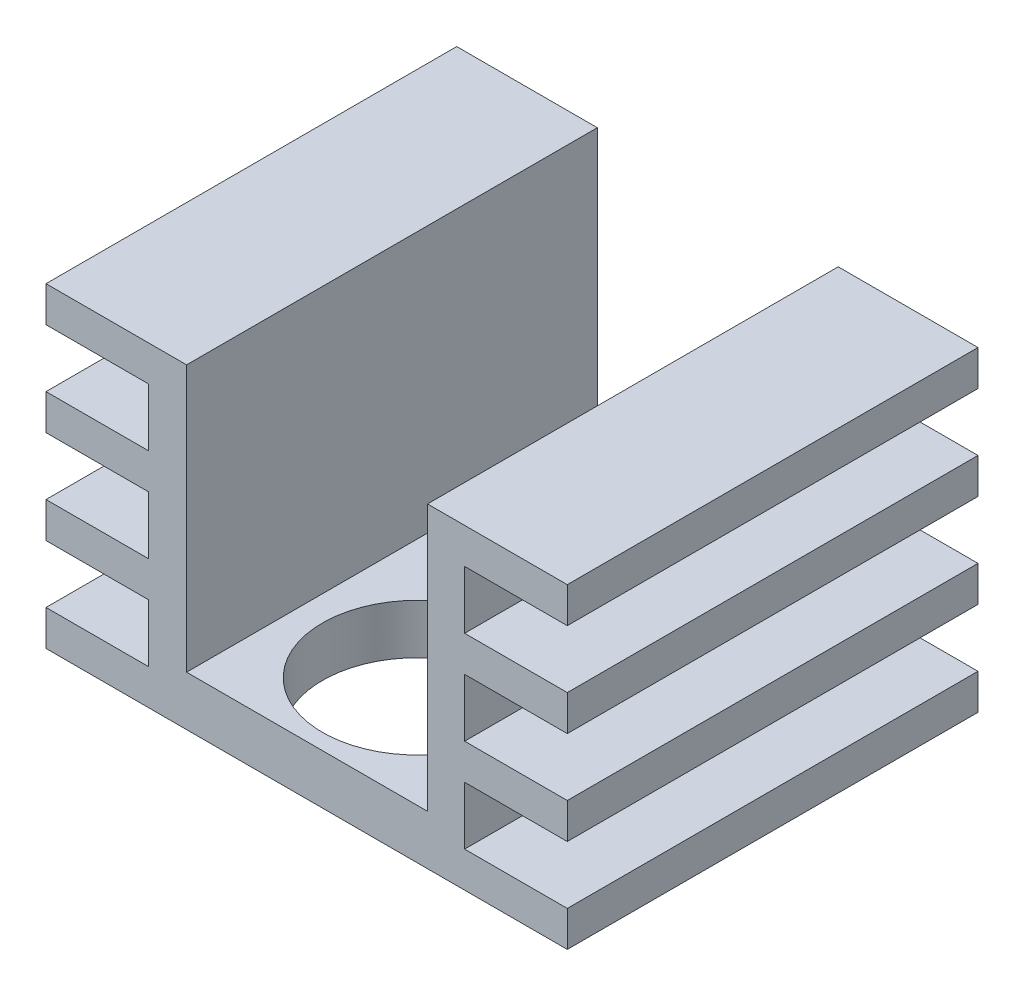
ISO-10303-21;
HEADER;
FILE_DESCRIPTION(('STEP AP214'),'2;1');
FILE_NAME('part.step','',(''),(''),'','','');
FILE_SCHEMA(('AUTOMOTIVE_DESIGN { 1 0 10303 214 1 1 1 1 }'));
ENDSEC;
DATA;
#1=APPLICATION_CONTEXT('core data for automotive mechanical design processes');
#2=APPLICATION_PROTOCOL_DEFINITION('international standard','automotive_design',2000,#1);
#3=PRODUCT_CONTEXT('',#1,'mechanical');
#4=PRODUCT('Part','Part','',(#3));
#5=PRODUCT_RELATED_PRODUCT_CATEGORY('part','',(#4));
#6=PRODUCT_DEFINITION_FORMATION('','',#4);
#7=PRODUCT_DEFINITION_CONTEXT('part definition',#1,'design');
#8=PRODUCT_DEFINITION('design','',#6,#7);
#9=PRODUCT_DEFINITION_SHAPE('','',#8);
#10=(LENGTH_UNIT() NAMED_UNIT(*) SI_UNIT(.MILLI.,.METRE.));
#11=(NAMED_UNIT(*) PLANE_ANGLE_UNIT() SI_UNIT($,.RADIAN.));
#12=(NAMED_UNIT(*) SI_UNIT($,.STERADIAN.) SOLID_ANGLE_UNIT());
#13=UNCERTAINTY_MEASURE_WITH_UNIT(LENGTH_MEASURE(1.E-05),#10,'distance_accuracy_value','');
#14=(GEOMETRIC_REPRESENTATION_CONTEXT(3) GLOBAL_UNCERTAINTY_ASSIGNED_CONTEXT((#13)) GLOBAL_UNIT_ASSIGNED_CONTEXT((#10,
#11,#12)) REPRESENTATION_CONTEXT('',''));
#15=CARTESIAN_POINT('',(0.,0.,0.));
#16=DIRECTION('',(0.,0.,1.));
#17=DIRECTION('',(1.,0.,0.));
#18=AXIS2_PLACEMENT_3D('',#15,#16,#17);
#19=CARTESIAN_POINT('',(0.,20.,0.));
#20=DIRECTION('',(0.,-1.,0.));
#21=DIRECTION('',(0.,0.,-1.));
#22=AXIS2_PLACEMENT_3D('',#19,#20,#21);
#23=PLANE('',#22);
#24=DIRECTION('',(1.,0.,0.));
#25=VECTOR('',#24,1.);
#26=CARTESIAN_POINT('',(33.,20.,0.));
#27=LINE('',#26,#25);
#28=CARTESIAN_POINT('',(0.,20.,0.));
#29=VERTEX_POINT('',#28);
#30=CARTESIAN_POINT('',(8.9,20.,0.));
#31=VERTEX_POINT('',#30);
#32=EDGE_CURVE('E437',#29,#31,#27,.T.);
#33=ORIENTED_EDGE('',*,*,#32,.T.);
#34=DIRECTION('',(0.,0.,1.));
#35=VECTOR('',#34,1.);
#36=CARTESIAN_POINT('',(8.9,20.,-26.));
#37=LINE('',#36,#35);
#38=CARTESIAN_POINT('',(8.9,20.,-26.));
#39=VERTEX_POINT('',#38);
#40=EDGE_CURVE('E272',#39,#31,#37,.T.);
#41=ORIENTED_EDGE('',*,*,#40,.F.);
#42=DIRECTION('',(-1.,0.,0.));
#43=VECTOR('',#42,1.);
#44=CARTESIAN_POINT('',(0.,20.,-26.));
#45=LINE('',#44,#43);
#46=CARTESIAN_POINT('',(0.,20.,-26.));
#47=VERTEX_POINT('',#46);
#48=EDGE_CURVE('E263',#39,#47,#45,.T.);
#49=ORIENTED_EDGE('',*,*,#48,.T.);
#50=DIRECTION('',(0.,0.,1.));
#51=VECTOR('',#50,1.);
#52=CARTESIAN_POINT('',(0.,20.,0.));
#53=LINE('',#52,#51);
#54=EDGE_CURVE('E446',#47,#29,#53,.T.);
#55=ORIENTED_EDGE('',*,*,#54,.T.);
#56=EDGE_LOOP('',(#33,#41,#49,#55));
#57=FACE_BOUND('',#56,.T.);
#58=ADVANCED_FACE('F32',(#57),#23,.F.);
#59=CARTESIAN_POINT('',(33.,20.,-26.));
#60=DIRECTION('',(-1.,0.,0.));
#61=DIRECTION('',(0.,0.,1.));
#62=AXIS2_PLACEMENT_3D('',#59,#60,#61);
#63=PLANE('',#62);
#64=DIRECTION('',(0.,-1.,0.));
#65=VECTOR('',#64,1.);
#66=CARTESIAN_POINT('',(33.,20.,-26.));
#67=LINE('',#66,#65);
#68=CARTESIAN_POINT('',(33.,2.25,-26.));
#69=VERTEX_POINT('',#68);
#70=CARTESIAN_POINT('',(33.,0.,-26.));
#71=VERTEX_POINT('',#70);
#72=EDGE_CURVE('E469',#69,#71,#67,.T.);
#73=ORIENTED_EDGE('',*,*,#72,.F.);
#74=DIRECTION('',(0.,0.,1.));
#75=VECTOR('',#74,1.);
#76=CARTESIAN_POINT('',(33.,2.25,-26.));
#77=LINE('',#76,#75);
#78=CARTESIAN_POINT('',(33.,2.25,0.));
#79=VERTEX_POINT('',#78);
#80=EDGE_CURVE('E294',#69,#79,#77,.T.);
#81=ORIENTED_EDGE('',*,*,#80,.T.);
#82=DIRECTION('',(0.,-1.,0.));
#83=VECTOR('',#82,1.);
#84=CARTESIAN_POINT('',(33.,20.,0.));
#85=LINE('',#84,#83);
#86=CARTESIAN_POINT('',(33.,0.,0.));
#87=VERTEX_POINT('',#86);
#88=EDGE_CURVE('E42',#79,#87,#85,.T.);
#89=ORIENTED_EDGE('',*,*,#88,.T.);
#90=DIRECTION('',(0.,0.,-1.));
#91=VECTOR('',#90,1.);
#92=CARTESIAN_POINT('',(33.,0.,-26.));
#93=LINE('',#92,#91);
#94=EDGE_CURVE('E451',#87,#71,#93,.T.);
#95=ORIENTED_EDGE('',*,*,#94,.T.);
#96=EDGE_LOOP('',(#73,#81,#89,#95));
#97=FACE_BOUND('',#96,.T.);
#98=ADVANCED_FACE('F502',(#97),#63,.F.);
#99=CARTESIAN_POINT('',(33.,8.16666666666667,0.));
#100=VERTEX_POINT('',#99);
#101=CARTESIAN_POINT('',(33.,5.91666666666667,0.));
#102=VERTEX_POINT('',#101);
#103=EDGE_CURVE('E477',#100,#102,#85,.T.);
#104=ORIENTED_EDGE('',*,*,#103,.T.);
#105=DIRECTION('',(0.,0.,1.));
#106=VECTOR('',#105,1.);
#107=CARTESIAN_POINT('',(33.,5.91666666666667,-26.));
#108=LINE('',#107,#106);
#109=CARTESIAN_POINT('',(33.,5.91666666666667,-26.));
#110=VERTEX_POINT('',#109);
#111=EDGE_CURVE('E286',#110,#102,#108,.T.);
#112=ORIENTED_EDGE('',*,*,#111,.F.);
#113=CARTESIAN_POINT('',(33.,8.16666666666667,-26.));
#114=VERTEX_POINT('',#113);
#115=EDGE_CURVE('E479',#114,#110,#67,.T.);
#116=ORIENTED_EDGE('',*,*,#115,.F.);
#117=DIRECTION('',(0.,0.,1.));
#118=VECTOR('',#117,1.);
#119=CARTESIAN_POINT('',(33.,8.16666666666667,-26.));
#120=LINE('',#119,#118);
#121=EDGE_CURVE('E320',#114,#100,#120,.T.);
#122=ORIENTED_EDGE('',*,*,#121,.T.);
#123=EDGE_LOOP('',(#104,#112,#116,#122));
#124=FACE_BOUND('',#123,.T.);
#125=ADVANCED_FACE('F487',(#124),#63,.F.);
#126=CARTESIAN_POINT('',(33.,14.0833333333333,0.));
#127=VERTEX_POINT('',#126);
#128=CARTESIAN_POINT('',(33.,11.8333333333333,0.));
#129=VERTEX_POINT('',#128);
#130=EDGE_CURVE('E41',#127,#129,#85,.T.);
#131=ORIENTED_EDGE('',*,*,#130,.T.);
#132=DIRECTION('',(0.,0.,1.));
#133=VECTOR('',#132,1.);
#134=CARTESIAN_POINT('',(33.,11.8333333333333,-26.));
#135=LINE('',#134,#133);
#136=CARTESIAN_POINT('',(33.,11.8333333333333,-26.));
#137=VERTEX_POINT('',#136);
#138=EDGE_CURVE('E313',#137,#129,#135,.T.);
#139=ORIENTED_EDGE('',*,*,#138,.F.);
#140=CARTESIAN_POINT('',(33.,14.0833333333333,-26.));
#141=VERTEX_POINT('',#140);
#142=EDGE_CURVE('E474',#141,#137,#67,.T.);
#143=ORIENTED_EDGE('',*,*,#142,.F.);
#144=DIRECTION('',(0.,0.,1.));
#145=VECTOR('',#144,1.);
#146=CARTESIAN_POINT('',(33.,14.0833333333333,-26.));
#147=LINE('',#146,#145);
#148=EDGE_CURVE('E346',#141,#127,#147,.T.);
#149=ORIENTED_EDGE('',*,*,#148,.T.);
#150=EDGE_LOOP('',(#131,#139,#143,#149));
#151=FACE_BOUND('',#150,.T.);
#152=ADVANCED_FACE('F546',(#151),#63,.F.);
#153=CARTESIAN_POINT('',(0.,20.,0.));
#154=DIRECTION('',(1.,0.,0.));
#155=DIRECTION('',(0.,0.,-1.));
#156=AXIS2_PLACEMENT_3D('',#153,#154,#155);
#157=PLANE('',#156);
#158=DIRECTION('',(0.,-1.,0.));
#159=VECTOR('',#158,1.);
#160=CARTESIAN_POINT('',(0.,20.,-26.));
#161=LINE('',#160,#159);
#162=CARTESIAN_POINT('',(0.,17.75,-26.));
#163=VERTEX_POINT('',#162);
#164=EDGE_CURVE('E466',#47,#163,#161,.T.);
#165=ORIENTED_EDGE('',*,*,#164,.T.);
#166=DIRECTION('',(0.,0.,1.));
#167=VECTOR('',#166,1.);
#168=CARTESIAN_POINT('',(0.,17.75,-26.));
#169=LINE('',#168,#167);
#170=CARTESIAN_POINT('',(0.,17.75,0.));
#171=VERTEX_POINT('',#170);
#172=EDGE_CURVE('E372',#163,#171,#169,.T.);
#173=ORIENTED_EDGE('',*,*,#172,.T.);
#174=DIRECTION('',(0.,-1.,0.));
#175=VECTOR('',#174,1.);
#176=CARTESIAN_POINT('',(0.,20.,0.));
#177=LINE('',#176,#175);
#178=EDGE_CURVE('E460',#29,#171,#177,.T.);
#179=ORIENTED_EDGE('',*,*,#178,.F.);
#180=ORIENTED_EDGE('',*,*,#54,.F.);
#181=EDGE_LOOP('',(#165,#173,#179,#180));
#182=FACE_BOUND('',#181,.T.);
#183=ADVANCED_FACE('F538',(#182),#157,.F.);
#184=CARTESIAN_POINT('',(0.,2.25,0.));
#185=VERTEX_POINT('',#184);
#186=CARTESIAN_POINT('',(0.,0.,0.));
#187=VERTEX_POINT('',#186);
#188=EDGE_CURVE('E448',#185,#187,#177,.T.);
#189=ORIENTED_EDGE('',*,*,#188,.F.);
#190=DIRECTION('',(0.,0.,1.));
#191=VECTOR('',#190,1.);
#192=CARTESIAN_POINT('',(0.,2.25,-26.));
#193=LINE('',#192,#191);
#194=CARTESIAN_POINT('',(0.,2.25,-26.));
#195=VERTEX_POINT('',#194);
#196=EDGE_CURVE('E401',#195,#185,#193,.T.);
#197=ORIENTED_EDGE('',*,*,#196,.F.);
#198=CARTESIAN_POINT('',(0.,0.,-26.));
#199=VERTEX_POINT('',#198);
#200=EDGE_CURVE('E463',#195,#199,#161,.T.);
#201=ORIENTED_EDGE('',*,*,#200,.T.);
#202=DIRECTION('',(0.,0.,1.));
#203=VECTOR('',#202,1.);
#204=CARTESIAN_POINT('',(0.,0.,0.));
#205=LINE('',#204,#203);
#206=EDGE_CURVE('E457',#199,#187,#205,.T.);
#207=ORIENTED_EDGE('',*,*,#206,.T.);
#208=EDGE_LOOP('',(#189,#197,#201,#207));
#209=FACE_BOUND('',#208,.T.);
#210=ADVANCED_FACE('F536',(#209),#157,.F.);
#211=CARTESIAN_POINT('',(0.,14.0833333333333,0.));
#212=VERTEX_POINT('',#211);
#213=CARTESIAN_POINT('',(0.,11.8333333333333,0.));
#214=VERTEX_POINT('',#213);
#215=EDGE_CURVE('E464',#212,#214,#177,.T.);
#216=ORIENTED_EDGE('',*,*,#215,.F.);
#217=DIRECTION('',(0.,0.,1.));
#218=VECTOR('',#217,1.);
#219=CARTESIAN_POINT('',(0.,14.0833333333333,-26.));
#220=LINE('',#219,#218);
#221=CARTESIAN_POINT('',(0.,14.0833333333333,-26.));
#222=VERTEX_POINT('',#221);
#223=EDGE_CURVE('E365',#222,#212,#220,.T.);
#224=ORIENTED_EDGE('',*,*,#223,.F.);
#225=CARTESIAN_POINT('',(0.,11.8333333333333,-26.));
#226=VERTEX_POINT('',#225);
#227=EDGE_CURVE('E470',#222,#226,#161,.T.);
#228=ORIENTED_EDGE('',*,*,#227,.T.);
#229=DIRECTION('',(0.,0.,1.));
#230=VECTOR('',#229,1.);
#231=CARTESIAN_POINT('',(0.,11.8333333333333,-26.));
#232=LINE('',#231,#230);
#233=EDGE_CURVE('E425',#226,#214,#232,.T.);
#234=ORIENTED_EDGE('',*,*,#233,.T.);
#235=EDGE_LOOP('',(#216,#224,#228,#234));
#236=FACE_BOUND('',#235,.T.);
#237=ADVANCED_FACE('F519',(#236),#157,.F.);
#238=CARTESIAN_POINT('',(33.,20.,-26.));
#239=VERTEX_POINT('',#238);
#240=CARTESIAN_POINT('',(24.15,20.,-26.));
#241=VERTEX_POINT('',#240);
#242=EDGE_CURVE('E443',#239,#241,#45,.T.);
#243=ORIENTED_EDGE('',*,*,#242,.T.);
#244=DIRECTION('',(0.,0.,1.));
#245=VECTOR('',#244,1.);
#246=CARTESIAN_POINT('',(24.15,20.,-26.));
#247=LINE('',#246,#245);
#248=CARTESIAN_POINT('',(24.15,20.,0.));
#249=VERTEX_POINT('',#248);
#250=EDGE_CURVE('E274',#241,#249,#247,.T.);
#251=ORIENTED_EDGE('',*,*,#250,.T.);
#252=CARTESIAN_POINT('',(33.,20.,0.));
#253=VERTEX_POINT('',#252);
#254=EDGE_CURVE('E441',#249,#253,#27,.T.);
#255=ORIENTED_EDGE('',*,*,#254,.T.);
#256=DIRECTION('',(0.,0.,-1.));
#257=VECTOR('',#256,1.);
#258=CARTESIAN_POINT('',(33.,20.,-26.));
#259=LINE('',#258,#257);
#260=EDGE_CURVE('E440',#253,#239,#259,.T.);
#261=ORIENTED_EDGE('',*,*,#260,.T.);
#262=EDGE_LOOP('',(#243,#251,#255,#261));
#263=FACE_BOUND('',#262,.T.);
#264=ADVANCED_FACE('F544',(#263),#23,.F.);
#265=CARTESIAN_POINT('',(0.,0.,0.));
#266=DIRECTION('',(0.,-1.,0.));
#267=DIRECTION('',(0.,0.,-1.));
#268=AXIS2_PLACEMENT_3D('',#265,#266,#267);
#269=PLANE('',#268);
#270=DIRECTION('',(1.,0.,0.));
#271=VECTOR('',#270,1.);
#272=CARTESIAN_POINT('',(33.,0.,0.));
#273=LINE('',#272,#271);
#274=EDGE_CURVE('E436',#187,#87,#273,.T.);
#275=ORIENTED_EDGE('',*,*,#274,.F.);
#276=ORIENTED_EDGE('',*,*,#206,.F.);
#277=DIRECTION('',(-1.,0.,0.));
#278=VECTOR('',#277,1.);
#279=CARTESIAN_POINT('',(0.,0.,-26.));
#280=LINE('',#279,#278);
#281=EDGE_CURVE('E454',#71,#199,#280,.T.);
#282=ORIENTED_EDGE('',*,*,#281,.F.);
#283=ORIENTED_EDGE('',*,*,#94,.F.);
#284=EDGE_LOOP('',(#275,#276,#282,#283));
#285=FACE_BOUND('',#284,.T.);
#286=CARTESIAN_POINT('',(16.5,0.,-7.));
#287=DIRECTION('',(0.,1.,0.));
#288=DIRECTION('',(0.,0.,1.));
#289=AXIS2_PLACEMENT_3D('',#286,#287,#288);
#290=CIRCLE('',#289,6.);
#291=CARTESIAN_POINT('',(16.5,0.,-1.));
#292=VERTEX_POINT('',#291);
#293=EDGE_CURVE('E428',#292,#292,#290,.T.);
#294=ORIENTED_EDGE('',*,*,#293,.T.);
#295=EDGE_LOOP('',(#294));
#296=FACE_BOUND('',#295,.T.);
#297=ADVANCED_FACE('F508',(#285,#296),#269,.T.);
#298=CARTESIAN_POINT('',(33.,20.,0.));
#299=DIRECTION('',(0.,0.,-1.));
#300=DIRECTION('',(-1.,0.,0.));
#301=AXIS2_PLACEMENT_3D('',#298,#299,#300);
#302=PLANE('',#301);
#303=DIRECTION('',(1.,0.,0.));
#304=VECTOR('',#303,1.);
#305=CARTESIAN_POINT('',(8.9,3.15,0.));
#306=LINE('',#305,#304);
#307=CARTESIAN_POINT('',(8.9,3.15,0.));
#308=VERTEX_POINT('',#307);
#309=CARTESIAN_POINT('',(24.15,3.15,0.));
#310=VERTEX_POINT('',#309);
#311=EDGE_CURVE('E266',#308,#310,#306,.T.);
#312=ORIENTED_EDGE('',*,*,#311,.F.);
#313=DIRECTION('',(0.,-1.,0.));
#314=VECTOR('',#313,1.);
#315=CARTESIAN_POINT('',(8.9,20.,0.));
#316=LINE('',#315,#314);
#317=EDGE_CURVE('E249',#31,#308,#316,.T.);
#318=ORIENTED_EDGE('',*,*,#317,.F.);
#319=ORIENTED_EDGE('',*,*,#32,.F.);
#320=ORIENTED_EDGE('',*,*,#178,.T.);
#321=DIRECTION('',(-1.,0.,0.));
#322=VECTOR('',#321,1.);
#323=CARTESIAN_POINT('',(0.,17.75,0.));
#324=LINE('',#323,#322);
#325=CARTESIAN_POINT('',(6.5,17.75,0.));
#326=VERTEX_POINT('',#325);
#327=EDGE_CURVE('E359',#326,#171,#324,.T.);
#328=ORIENTED_EDGE('',*,*,#327,.F.);
#329=DIRECTION('',(0.,1.,0.));
#330=VECTOR('',#329,1.);
#331=CARTESIAN_POINT('',(6.5,17.75,0.));
#332=LINE('',#331,#330);
#333=CARTESIAN_POINT('',(6.5,14.0833333333333,0.));
#334=VERTEX_POINT('',#333);
#335=EDGE_CURVE('E368',#334,#326,#332,.T.);
#336=ORIENTED_EDGE('',*,*,#335,.F.);
#337=DIRECTION('',(1.,0.,0.));
#338=VECTOR('',#337,1.);
#339=CARTESIAN_POINT('',(0.,14.0833333333333,0.));
#340=LINE('',#339,#338);
#341=EDGE_CURVE('E349',#212,#334,#340,.T.);
#342=ORIENTED_EDGE('',*,*,#341,.F.);
#343=ORIENTED_EDGE('',*,*,#215,.T.);
#344=DIRECTION('',(-1.,0.,0.));
#345=VECTOR('',#344,1.);
#346=CARTESIAN_POINT('',(0.,11.8333333333333,0.));
#347=LINE('',#346,#345);
#348=CARTESIAN_POINT('',(6.5,11.8333333333333,0.));
#349=VERTEX_POINT('',#348);
#350=EDGE_CURVE('E411',#349,#214,#347,.T.);
#351=ORIENTED_EDGE('',*,*,#350,.F.);
#352=DIRECTION('',(0.,1.,0.));
#353=VECTOR('',#352,1.);
#354=CARTESIAN_POINT('',(6.5,8.16666666666667,0.));
#355=LINE('',#354,#353);
#356=CARTESIAN_POINT('',(6.5,8.16666666666667,0.));
#357=VERTEX_POINT('',#356);
#358=EDGE_CURVE('E420',#357,#349,#355,.T.);
#359=ORIENTED_EDGE('',*,*,#358,.F.);
#360=DIRECTION('',(1.,0.,0.));
#361=VECTOR('',#360,1.);
#362=CARTESIAN_POINT('',(0.,8.16666666666667,0.));
#363=LINE('',#362,#361);
#364=CARTESIAN_POINT('',(0.,8.16666666666667,0.));
#365=VERTEX_POINT('',#364);
#366=EDGE_CURVE('E400',#365,#357,#363,.T.);
#367=ORIENTED_EDGE('',*,*,#366,.F.);
#368=CARTESIAN_POINT('',(0.,5.91666666666667,0.));
#369=VERTEX_POINT('',#368);
#370=EDGE_CURVE('E465',#365,#369,#177,.T.);
#371=ORIENTED_EDGE('',*,*,#370,.T.);
#372=DIRECTION('',(-1.,0.,0.));
#373=VECTOR('',#372,1.);
#374=CARTESIAN_POINT('',(0.,5.91666666666667,0.));
#375=LINE('',#374,#373);
#376=CARTESIAN_POINT('',(6.5,5.91666666666667,0.));
#377=VERTEX_POINT('',#376);
#378=EDGE_CURVE('E394',#377,#369,#375,.T.);
#379=ORIENTED_EDGE('',*,*,#378,.F.);
#380=DIRECTION('',(0.,1.,0.));
#381=VECTOR('',#380,1.);
#382=CARTESIAN_POINT('',(6.5,2.25,0.));
#383=LINE('',#382,#381);
#384=CARTESIAN_POINT('',(6.5,2.25,0.));
#385=VERTEX_POINT('',#384);
#386=EDGE_CURVE('E375',#385,#377,#383,.T.);
#387=ORIENTED_EDGE('',*,*,#386,.F.);
#388=DIRECTION('',(1.,0.,0.));
#389=VECTOR('',#388,1.);
#390=CARTESIAN_POINT('',(0.,2.25,0.));
#391=LINE('',#390,#389);
#392=EDGE_CURVE('E385',#185,#385,#391,.T.);
#393=ORIENTED_EDGE('',*,*,#392,.F.);
#394=ORIENTED_EDGE('',*,*,#188,.T.);
#395=ORIENTED_EDGE('',*,*,#274,.T.);
#396=ORIENTED_EDGE('',*,*,#88,.F.);
#397=DIRECTION('',(1.,0.,0.));
#398=VECTOR('',#397,1.);
#399=CARTESIAN_POINT('',(33.,2.25,0.));
#400=LINE('',#399,#398);
#401=CARTESIAN_POINT('',(26.5,2.25,0.));
#402=VERTEX_POINT('',#401);
#403=EDGE_CURVE('E281',#402,#79,#400,.T.);
#404=ORIENTED_EDGE('',*,*,#403,.F.);
#405=DIRECTION('',(0.,-1.,0.));
#406=VECTOR('',#405,1.);
#407=CARTESIAN_POINT('',(26.5,5.91666666666667,0.));
#408=LINE('',#407,#406);
#409=CARTESIAN_POINT('',(26.5,5.91666666666667,0.));
#410=VERTEX_POINT('',#409);
#411=EDGE_CURVE('E290',#410,#402,#408,.T.);
#412=ORIENTED_EDGE('',*,*,#411,.F.);
#413=DIRECTION('',(-1.,0.,0.));
#414=VECTOR('',#413,1.);
#415=CARTESIAN_POINT('',(33.,5.91666666666667,0.));
#416=LINE('',#415,#414);
#417=EDGE_CURVE('E287',#102,#410,#416,.T.);
#418=ORIENTED_EDGE('',*,*,#417,.F.);
#419=ORIENTED_EDGE('',*,*,#103,.F.);
#420=DIRECTION('',(1.,0.,0.));
#421=VECTOR('',#420,1.);
#422=CARTESIAN_POINT('',(33.,8.16666666666667,0.));
#423=LINE('',#422,#421);
#424=CARTESIAN_POINT('',(26.5,8.16666666666667,0.));
#425=VERTEX_POINT('',#424);
#426=EDGE_CURVE('E307',#425,#100,#423,.T.);
#427=ORIENTED_EDGE('',*,*,#426,.F.);
#428=DIRECTION('',(0.,-1.,0.));
#429=VECTOR('',#428,1.);
#430=CARTESIAN_POINT('',(26.5,11.8333333333333,0.));
#431=LINE('',#430,#429);
#432=CARTESIAN_POINT('',(26.5,11.8333333333333,0.));
#433=VERTEX_POINT('',#432);
#434=EDGE_CURVE('E316',#433,#425,#431,.T.);
#435=ORIENTED_EDGE('',*,*,#434,.F.);
#436=DIRECTION('',(-1.,0.,0.));
#437=VECTOR('',#436,1.);
#438=CARTESIAN_POINT('',(33.,11.8333333333333,0.));
#439=LINE('',#438,#437);
#440=EDGE_CURVE('E297',#129,#433,#439,.T.);
#441=ORIENTED_EDGE('',*,*,#440,.F.);
#442=ORIENTED_EDGE('',*,*,#130,.F.);
#443=DIRECTION('',(1.,0.,0.));
#444=VECTOR('',#443,1.);
#445=CARTESIAN_POINT('',(33.,14.0833333333333,0.));
#446=LINE('',#445,#444);
#447=CARTESIAN_POINT('',(26.5,14.0833333333333,0.));
#448=VERTEX_POINT('',#447);
#449=EDGE_CURVE('E333',#448,#127,#446,.T.);
#450=ORIENTED_EDGE('',*,*,#449,.F.);
#451=DIRECTION('',(0.,-1.,0.));
#452=VECTOR('',#451,1.);
#453=CARTESIAN_POINT('',(26.5,17.75,0.));
#454=LINE('',#453,#452);
#455=CARTESIAN_POINT('',(26.5,17.75,0.));
#456=VERTEX_POINT('',#455);
#457=EDGE_CURVE('E342',#456,#448,#454,.T.);
#458=ORIENTED_EDGE('',*,*,#457,.F.);
#459=DIRECTION('',(-1.,0.,0.));
#460=VECTOR('',#459,1.);
#461=CARTESIAN_POINT('',(33.,17.75,0.));
#462=LINE('',#461,#460);
#463=CARTESIAN_POINT('',(33.,17.75,0.));
#464=VERTEX_POINT('',#463);
#465=EDGE_CURVE('E323',#464,#456,#462,.T.);
#466=ORIENTED_EDGE('',*,*,#465,.F.);
#467=EDGE_CURVE('E11',#253,#464,#85,.T.);
#468=ORIENTED_EDGE('',*,*,#467,.F.);
#469=ORIENTED_EDGE('',*,*,#254,.F.);
#470=DIRECTION('',(0.,1.,0.));
#471=VECTOR('',#470,1.);
#472=CARTESIAN_POINT('',(24.15,20.,0.));
#473=LINE('',#472,#471);
#474=EDGE_CURVE('E264',#310,#249,#473,.T.);
#475=ORIENTED_EDGE('',*,*,#474,.F.);
#476=EDGE_LOOP('',(#312,#318,#319,#320,#328,#336,#342,#343,#351,#359,#367,#371,#379,#387,#393,
#394,#395,#396,#404,#412,#418,#419,#427,#435,#441,#442,#450,#458,#466,#468,#469,#475));
#477=FACE_BOUND('',#476,.T.);
#478=ADVANCED_FACE('F34',(#477),#302,.F.);
#479=ORIENTED_EDGE('',*,*,#467,.T.);
#480=DIRECTION('',(0.,0.,1.));
#481=VECTOR('',#480,1.);
#482=CARTESIAN_POINT('',(33.,17.75,-26.));
#483=LINE('',#482,#481);
#484=CARTESIAN_POINT('',(33.,17.75,-26.));
#485=VERTEX_POINT('',#484);
#486=EDGE_CURVE('E339',#485,#464,#483,.T.);
#487=ORIENTED_EDGE('',*,*,#486,.F.);
#488=EDGE_CURVE('E472',#239,#485,#67,.T.);
#489=ORIENTED_EDGE('',*,*,#488,.F.);
#490=ORIENTED_EDGE('',*,*,#260,.F.);
#491=EDGE_LOOP('',(#479,#487,#489,#490));
#492=FACE_BOUND('',#491,.T.);
#493=ADVANCED_FACE('F556',(#492),#63,.F.);
#494=CARTESIAN_POINT('',(0.,20.,-26.));
#495=DIRECTION('',(0.,0.,1.));
#496=DIRECTION('',(1.,0.,0.));
#497=AXIS2_PLACEMENT_3D('',#494,#495,#496);
#498=PLANE('',#497);
#499=ORIENTED_EDGE('',*,*,#48,.F.);
#500=DIRECTION('',(0.,-1.,0.));
#501=VECTOR('',#500,1.);
#502=CARTESIAN_POINT('',(8.9,20.,-26.));
#503=LINE('',#502,#501);
#504=CARTESIAN_POINT('',(8.9,3.15,-26.));
#505=VERTEX_POINT('',#504);
#506=EDGE_CURVE('E246',#39,#505,#503,.T.);
#507=ORIENTED_EDGE('',*,*,#506,.T.);
#508=DIRECTION('',(1.,0.,0.));
#509=VECTOR('',#508,1.);
#510=CARTESIAN_POINT('',(8.9,3.15,-26.));
#511=LINE('',#510,#509);
#512=CARTESIAN_POINT('',(24.15,3.15,-26.));
#513=VERTEX_POINT('',#512);
#514=EDGE_CURVE('E256',#505,#513,#511,.T.);
#515=ORIENTED_EDGE('',*,*,#514,.T.);
#516=DIRECTION('',(0.,1.,0.));
#517=VECTOR('',#516,1.);
#518=CARTESIAN_POINT('',(24.15,20.,-26.));
#519=LINE('',#518,#517);
#520=EDGE_CURVE('E49',#513,#241,#519,.T.);
#521=ORIENTED_EDGE('',*,*,#520,.T.);
#522=ORIENTED_EDGE('',*,*,#242,.F.);
#523=ORIENTED_EDGE('',*,*,#488,.T.);
#524=DIRECTION('',(-1.,0.,0.));
#525=VECTOR('',#524,1.);
#526=CARTESIAN_POINT('',(33.,17.75,-26.));
#527=LINE('',#526,#525);
#528=CARTESIAN_POINT('',(26.5,17.75,-26.));
#529=VERTEX_POINT('',#528);
#530=EDGE_CURVE('E329',#485,#529,#527,.T.);
#531=ORIENTED_EDGE('',*,*,#530,.T.);
#532=DIRECTION('',(0.,-1.,0.));
#533=VECTOR('',#532,1.);
#534=CARTESIAN_POINT('',(26.5,17.75,-26.));
#535=LINE('',#534,#533);
#536=CARTESIAN_POINT('',(26.5,14.0833333333333,-26.));
#537=VERTEX_POINT('',#536);
#538=EDGE_CURVE('E332',#529,#537,#535,.T.);
#539=ORIENTED_EDGE('',*,*,#538,.T.);
#540=DIRECTION('',(1.,0.,0.));
#541=VECTOR('',#540,1.);
#542=CARTESIAN_POINT('',(33.,14.0833333333333,-26.));
#543=LINE('',#542,#541);
#544=EDGE_CURVE('E336',#537,#141,#543,.T.);
#545=ORIENTED_EDGE('',*,*,#544,.T.);
#546=ORIENTED_EDGE('',*,*,#142,.T.);
#547=DIRECTION('',(-1.,0.,0.));
#548=VECTOR('',#547,1.);
#549=CARTESIAN_POINT('',(33.,11.8333333333333,-26.));
#550=LINE('',#549,#548);
#551=CARTESIAN_POINT('',(26.5,11.8333333333333,-26.));
#552=VERTEX_POINT('',#551);
#553=EDGE_CURVE('E303',#137,#552,#550,.T.);
#554=ORIENTED_EDGE('',*,*,#553,.T.);
#555=DIRECTION('',(0.,-1.,0.));
#556=VECTOR('',#555,1.);
#557=CARTESIAN_POINT('',(26.5,11.8333333333333,-26.));
#558=LINE('',#557,#556);
#559=CARTESIAN_POINT('',(26.5,8.16666666666667,-26.));
#560=VERTEX_POINT('',#559);
#561=EDGE_CURVE('E306',#552,#560,#558,.T.);
#562=ORIENTED_EDGE('',*,*,#561,.T.);
#563=DIRECTION('',(1.,0.,0.));
#564=VECTOR('',#563,1.);
#565=CARTESIAN_POINT('',(33.,8.16666666666667,-26.));
#566=LINE('',#565,#564);
#567=EDGE_CURVE('E310',#560,#114,#566,.T.);
#568=ORIENTED_EDGE('',*,*,#567,.T.);
#569=ORIENTED_EDGE('',*,*,#115,.T.);
#570=DIRECTION('',(-1.,0.,0.));
#571=VECTOR('',#570,1.);
#572=CARTESIAN_POINT('',(33.,5.91666666666667,-26.));
#573=LINE('',#572,#571);
#574=CARTESIAN_POINT('',(26.5,5.91666666666667,-26.));
#575=VERTEX_POINT('',#574);
#576=EDGE_CURVE('E278',#110,#575,#573,.T.);
#577=ORIENTED_EDGE('',*,*,#576,.T.);
#578=DIRECTION('',(0.,-1.,0.));
#579=VECTOR('',#578,1.);
#580=CARTESIAN_POINT('',(26.5,5.91666666666667,-26.));
#581=LINE('',#580,#579);
#582=CARTESIAN_POINT('',(26.5,2.25,-26.));
#583=VERTEX_POINT('',#582);
#584=EDGE_CURVE('E57',#575,#583,#581,.T.);
#585=ORIENTED_EDGE('',*,*,#584,.T.);
#586=DIRECTION('',(1.,0.,0.));
#587=VECTOR('',#586,1.);
#588=CARTESIAN_POINT('',(33.,2.25,-26.));
#589=LINE('',#588,#587);
#590=EDGE_CURVE('E283',#583,#69,#589,.T.);
#591=ORIENTED_EDGE('',*,*,#590,.T.);
#592=ORIENTED_EDGE('',*,*,#72,.T.);
#593=ORIENTED_EDGE('',*,*,#281,.T.);
#594=ORIENTED_EDGE('',*,*,#200,.F.);
#595=DIRECTION('',(1.,0.,0.));
#596=VECTOR('',#595,1.);
#597=CARTESIAN_POINT('',(0.,2.25,-26.));
#598=LINE('',#597,#596);
#599=CARTESIAN_POINT('',(6.5,2.25,-26.));
#600=VERTEX_POINT('',#599);
#601=EDGE_CURVE('E388',#195,#600,#598,.T.);
#602=ORIENTED_EDGE('',*,*,#601,.T.);
#603=DIRECTION('',(0.,1.,0.));
#604=VECTOR('',#603,1.);
#605=CARTESIAN_POINT('',(6.5,2.25,-26.));
#606=LINE('',#605,#604);
#607=CARTESIAN_POINT('',(6.5,5.91666666666667,-26.));
#608=VERTEX_POINT('',#607);
#609=EDGE_CURVE('E381',#600,#608,#606,.T.);
#610=ORIENTED_EDGE('',*,*,#609,.T.);
#611=DIRECTION('',(-1.,0.,0.));
#612=VECTOR('',#611,1.);
#613=CARTESIAN_POINT('',(0.,5.91666666666667,-26.));
#614=LINE('',#613,#612);
#615=CARTESIAN_POINT('',(0.,5.91666666666667,-26.));
#616=VERTEX_POINT('',#615);
#617=EDGE_CURVE('E384',#608,#616,#614,.T.);
#618=ORIENTED_EDGE('',*,*,#617,.T.);
#619=CARTESIAN_POINT('',(0.,8.16666666666667,-26.));
#620=VERTEX_POINT('',#619);
#621=EDGE_CURVE('E471',#620,#616,#161,.T.);
#622=ORIENTED_EDGE('',*,*,#621,.F.);
#623=DIRECTION('',(1.,0.,0.));
#624=VECTOR('',#623,1.);
#625=CARTESIAN_POINT('',(0.,8.16666666666667,-26.));
#626=LINE('',#625,#624);
#627=CARTESIAN_POINT('',(6.5,8.16666666666667,-26.));
#628=VERTEX_POINT('',#627);
#629=EDGE_CURVE('E407',#620,#628,#626,.T.);
#630=ORIENTED_EDGE('',*,*,#629,.T.);
#631=DIRECTION('',(0.,1.,0.));
#632=VECTOR('',#631,1.);
#633=CARTESIAN_POINT('',(6.5,8.16666666666667,-26.));
#634=LINE('',#633,#632);
#635=CARTESIAN_POINT('',(6.5,11.8333333333333,-26.));
#636=VERTEX_POINT('',#635);
#637=EDGE_CURVE('E410',#628,#636,#634,.T.);
#638=ORIENTED_EDGE('',*,*,#637,.T.);
#639=DIRECTION('',(-1.,0.,0.));
#640=VECTOR('',#639,1.);
#641=CARTESIAN_POINT('',(0.,11.8333333333333,-26.));
#642=LINE('',#641,#640);
#643=EDGE_CURVE('E414',#636,#226,#642,.T.);
#644=ORIENTED_EDGE('',*,*,#643,.T.);
#645=ORIENTED_EDGE('',*,*,#227,.F.);
#646=DIRECTION('',(1.,0.,0.));
#647=VECTOR('',#646,1.);
#648=CARTESIAN_POINT('',(0.,14.0833333333333,-26.));
#649=LINE('',#648,#647);
#650=CARTESIAN_POINT('',(6.5,14.0833333333333,-26.));
#651=VERTEX_POINT('',#650);
#652=EDGE_CURVE('E355',#222,#651,#649,.T.);
#653=ORIENTED_EDGE('',*,*,#652,.T.);
#654=DIRECTION('',(0.,1.,0.));
#655=VECTOR('',#654,1.);
#656=CARTESIAN_POINT('',(6.5,17.75,-26.));
#657=LINE('',#656,#655);
#658=CARTESIAN_POINT('',(6.5,17.75,-26.));
#659=VERTEX_POINT('',#658);
#660=EDGE_CURVE('E358',#651,#659,#657,.T.);
#661=ORIENTED_EDGE('',*,*,#660,.T.);
#662=DIRECTION('',(-1.,0.,0.));
#663=VECTOR('',#662,1.);
#664=CARTESIAN_POINT('',(0.,17.75,-26.));
#665=LINE('',#664,#663);
#666=EDGE_CURVE('E362',#659,#163,#665,.T.);
#667=ORIENTED_EDGE('',*,*,#666,.T.);
#668=ORIENTED_EDGE('',*,*,#164,.F.);
#669=EDGE_LOOP('',(#499,#507,#515,#521,#522,#523,#531,#539,#545,#546,#554,#562,#568,#569,#577,
#585,#591,#592,#593,#594,#602,#610,#618,#622,#630,#638,#644,#645,#653,#661,#667,#668));
#670=FACE_BOUND('',#669,.T.);
#671=ADVANCED_FACE('F261',(#670),#498,.F.);
#672=ORIENTED_EDGE('',*,*,#621,.T.);
#673=DIRECTION('',(0.,0.,1.));
#674=VECTOR('',#673,1.);
#675=CARTESIAN_POINT('',(0.,5.91666666666667,-26.));
#676=LINE('',#675,#674);
#677=EDGE_CURVE('E403',#616,#369,#676,.T.);
#678=ORIENTED_EDGE('',*,*,#677,.T.);
#679=ORIENTED_EDGE('',*,*,#370,.F.);
#680=DIRECTION('',(0.,0.,1.));
#681=VECTOR('',#680,1.);
#682=CARTESIAN_POINT('',(0.,8.16666666666667,-26.));
#683=LINE('',#682,#681);
#684=EDGE_CURVE('E417',#620,#365,#683,.T.);
#685=ORIENTED_EDGE('',*,*,#684,.F.);
#686=EDGE_LOOP('',(#672,#678,#679,#685));
#687=FACE_BOUND('',#686,.T.);
#688=ADVANCED_FACE('F545',(#687),#157,.F.);
#689=CARTESIAN_POINT('',(16.5,20.,-7.));
#690=DIRECTION('',(0.,-1.,0.));
#691=DIRECTION('',(0.,0.,-1.));
#692=AXIS2_PLACEMENT_3D('',#689,#690,#691);
#693=CYLINDRICAL_SURFACE('',#692,6.);
#694=CARTESIAN_POINT('',(16.5,3.15,-7.));
#695=DIRECTION('',(0.,-1.,0.));
#696=DIRECTION('',(0.,0.,-1.));
#697=AXIS2_PLACEMENT_3D('',#694,#695,#696);
#698=CIRCLE('',#697,6.);
#699=CARTESIAN_POINT('',(16.5,3.15,-13.));
#700=VERTEX_POINT('',#699);
#701=EDGE_CURVE('E36',#700,#700,#698,.T.);
#702=ORIENTED_EDGE('',*,*,#701,.F.);
#703=EDGE_LOOP('',(#702));
#704=FACE_BOUND('',#703,.T.);
#705=ORIENTED_EDGE('',*,*,#293,.F.);
#706=EDGE_LOOP('',(#705));
#707=FACE_BOUND('',#706,.T.);
#708=ADVANCED_FACE('F637',(#704,#707),#693,.F.);
#709=CARTESIAN_POINT('',(0.,11.8333333333333,-26.));
#710=DIRECTION('',(0.,1.,0.));
#711=DIRECTION('',(0.,0.,1.));
#712=AXIS2_PLACEMENT_3D('',#709,#710,#711);
#713=PLANE('',#712);
#714=ORIENTED_EDGE('',*,*,#350,.T.);
#715=ORIENTED_EDGE('',*,*,#233,.F.);
#716=ORIENTED_EDGE('',*,*,#643,.F.);
#717=DIRECTION('',(0.,0.,1.));
#718=VECTOR('',#717,1.);
#719=CARTESIAN_POINT('',(6.5,11.8333333333333,-26.));
#720=LINE('',#719,#718);
#721=EDGE_CURVE('E429',#636,#349,#720,.T.);
#722=ORIENTED_EDGE('',*,*,#721,.T.);
#723=EDGE_LOOP('',(#714,#715,#716,#722));
#724=FACE_BOUND('',#723,.T.);
#725=ADVANCED_FACE('F522',(#724),#713,.F.);
#726=CARTESIAN_POINT('',(6.5,8.16666666666667,-26.));
#727=DIRECTION('',(1.,0.,0.));
#728=DIRECTION('',(0.,0.,-1.));
#729=AXIS2_PLACEMENT_3D('',#726,#727,#728);
#730=PLANE('',#729);
#731=ORIENTED_EDGE('',*,*,#358,.T.);
#732=ORIENTED_EDGE('',*,*,#721,.F.);
#733=ORIENTED_EDGE('',*,*,#637,.F.);
#734=DIRECTION('',(0.,0.,1.));
#735=VECTOR('',#734,1.);
#736=CARTESIAN_POINT('',(6.5,8.16666666666667,-26.));
#737=LINE('',#736,#735);
#738=EDGE_CURVE('E431',#628,#357,#737,.T.);
#739=ORIENTED_EDGE('',*,*,#738,.T.);
#740=EDGE_LOOP('',(#731,#732,#733,#739));
#741=FACE_BOUND('',#740,.T.);
#742=ADVANCED_FACE('F527',(#741),#730,.F.);
#743=CARTESIAN_POINT('',(0.,8.16666666666667,-26.));
#744=DIRECTION('',(0.,-1.,0.));
#745=DIRECTION('',(0.,0.,-1.));
#746=AXIS2_PLACEMENT_3D('',#743,#744,#745);
#747=PLANE('',#746);
#748=ORIENTED_EDGE('',*,*,#366,.T.);
#749=ORIENTED_EDGE('',*,*,#738,.F.);
#750=ORIENTED_EDGE('',*,*,#629,.F.);
#751=ORIENTED_EDGE('',*,*,#684,.T.);
#752=EDGE_LOOP('',(#748,#749,#750,#751));
#753=FACE_BOUND('',#752,.T.);
#754=ADVANCED_FACE('F633',(#753),#747,.F.);
#755=CARTESIAN_POINT('',(6.5,2.25,-26.));
#756=DIRECTION('',(1.,0.,0.));
#757=DIRECTION('',(0.,0.,-1.));
#758=AXIS2_PLACEMENT_3D('',#755,#756,#757);
#759=PLANE('',#758);
#760=ORIENTED_EDGE('',*,*,#386,.T.);
#761=DIRECTION('',(0.,0.,1.));
#762=VECTOR('',#761,1.);
#763=CARTESIAN_POINT('',(6.5,5.91666666666667,-26.));
#764=LINE('',#763,#762);
#765=EDGE_CURVE('E391',#608,#377,#764,.T.);
#766=ORIENTED_EDGE('',*,*,#765,.F.);
#767=ORIENTED_EDGE('',*,*,#609,.F.);
#768=DIRECTION('',(0.,0.,1.));
#769=VECTOR('',#768,1.);
#770=CARTESIAN_POINT('',(6.5,2.25,-26.));
#771=LINE('',#770,#769);
#772=EDGE_CURVE('E398',#600,#385,#771,.T.);
#773=ORIENTED_EDGE('',*,*,#772,.T.);
#774=EDGE_LOOP('',(#760,#766,#767,#773));
#775=FACE_BOUND('',#774,.T.);
#776=ADVANCED_FACE('F626',(#775),#759,.F.);
#777=CARTESIAN_POINT('',(0.,2.25,-26.));
#778=DIRECTION('',(0.,-1.,0.));
#779=DIRECTION('',(0.,0.,-1.));
#780=AXIS2_PLACEMENT_3D('',#777,#778,#779);
#781=PLANE('',#780);
#782=ORIENTED_EDGE('',*,*,#392,.T.);
#783=ORIENTED_EDGE('',*,*,#772,.F.);
#784=ORIENTED_EDGE('',*,*,#601,.F.);
#785=ORIENTED_EDGE('',*,*,#196,.T.);
#786=EDGE_LOOP('',(#782,#783,#784,#785));
#787=FACE_BOUND('',#786,.T.);
#788=ADVANCED_FACE('F623',(#787),#781,.F.);
#789=CARTESIAN_POINT('',(0.,5.91666666666667,-26.));
#790=DIRECTION('',(0.,1.,0.));
#791=DIRECTION('',(0.,0.,1.));
#792=AXIS2_PLACEMENT_3D('',#789,#790,#791);
#793=PLANE('',#792);
#794=ORIENTED_EDGE('',*,*,#378,.T.);
#795=ORIENTED_EDGE('',*,*,#677,.F.);
#796=ORIENTED_EDGE('',*,*,#617,.F.);
#797=ORIENTED_EDGE('',*,*,#765,.T.);
#798=EDGE_LOOP('',(#794,#795,#796,#797));
#799=FACE_BOUND('',#798,.T.);
#800=ADVANCED_FACE('F615',(#799),#793,.F.);
#801=CARTESIAN_POINT('',(0.,17.75,-26.));
#802=DIRECTION('',(0.,1.,0.));
#803=DIRECTION('',(0.,0.,1.));
#804=AXIS2_PLACEMENT_3D('',#801,#802,#803);
#805=PLANE('',#804);
#806=ORIENTED_EDGE('',*,*,#327,.T.);
#807=ORIENTED_EDGE('',*,*,#172,.F.);
#808=ORIENTED_EDGE('',*,*,#666,.F.);
#809=DIRECTION('',(0.,0.,1.));
#810=VECTOR('',#809,1.);
#811=CARTESIAN_POINT('',(6.5,17.75,-26.));
#812=LINE('',#811,#810);
#813=EDGE_CURVE('E376',#659,#326,#812,.T.);
#814=ORIENTED_EDGE('',*,*,#813,.T.);
#815=EDGE_LOOP('',(#806,#807,#808,#814));
#816=FACE_BOUND('',#815,.T.);
#817=ADVANCED_FACE('F611',(#816),#805,.F.);
#818=CARTESIAN_POINT('',(6.5,17.75,-26.));
#819=DIRECTION('',(1.,0.,0.));
#820=DIRECTION('',(0.,0.,-1.));
#821=AXIS2_PLACEMENT_3D('',#818,#819,#820);
#822=PLANE('',#821);
#823=ORIENTED_EDGE('',*,*,#335,.T.);
#824=ORIENTED_EDGE('',*,*,#813,.F.);
#825=ORIENTED_EDGE('',*,*,#660,.F.);
#826=DIRECTION('',(0.,0.,1.));
#827=VECTOR('',#826,1.);
#828=CARTESIAN_POINT('',(6.5,14.0833333333333,-26.));
#829=LINE('',#828,#827);
#830=EDGE_CURVE('E378',#651,#334,#829,.T.);
#831=ORIENTED_EDGE('',*,*,#830,.T.);
#832=EDGE_LOOP('',(#823,#824,#825,#831));
#833=FACE_BOUND('',#832,.T.);
#834=ADVANCED_FACE('F614',(#833),#822,.F.);
#835=CARTESIAN_POINT('',(0.,14.0833333333333,-26.));
#836=DIRECTION('',(0.,-1.,0.));
#837=DIRECTION('',(0.,0.,-1.));
#838=AXIS2_PLACEMENT_3D('',#835,#836,#837);
#839=PLANE('',#838);
#840=ORIENTED_EDGE('',*,*,#341,.T.);
#841=ORIENTED_EDGE('',*,*,#830,.F.);
#842=ORIENTED_EDGE('',*,*,#652,.F.);
#843=ORIENTED_EDGE('',*,*,#223,.T.);
#844=EDGE_LOOP('',(#840,#841,#842,#843));
#845=FACE_BOUND('',#844,.T.);
#846=ADVANCED_FACE('F608',(#845),#839,.F.);
#847=CARTESIAN_POINT('',(33.,14.0833333333333,-26.));
#848=DIRECTION('',(0.,-1.,0.));
#849=DIRECTION('',(1.,0.,0.));
#850=AXIS2_PLACEMENT_3D('',#847,#848,#849);
#851=PLANE('',#850);
#852=ORIENTED_EDGE('',*,*,#449,.T.);
#853=ORIENTED_EDGE('',*,*,#148,.F.);
#854=ORIENTED_EDGE('',*,*,#544,.F.);
#855=DIRECTION('',(0.,0.,1.));
#856=VECTOR('',#855,1.);
#857=CARTESIAN_POINT('',(26.5,14.0833333333333,-26.));
#858=LINE('',#857,#856);
#859=EDGE_CURVE('E350',#537,#448,#858,.T.);
#860=ORIENTED_EDGE('',*,*,#859,.T.);
#861=EDGE_LOOP('',(#852,#853,#854,#860));
#862=FACE_BOUND('',#861,.T.);
#863=ADVANCED_FACE('F605',(#862),#851,.F.);
#864=CARTESIAN_POINT('',(26.5,17.75,-26.));
#865=DIRECTION('',(-1.,0.,0.));
#866=DIRECTION('',(0.,0.,1.));
#867=AXIS2_PLACEMENT_3D('',#864,#865,#866);
#868=PLANE('',#867);
#869=ORIENTED_EDGE('',*,*,#457,.T.);
#870=ORIENTED_EDGE('',*,*,#859,.F.);
#871=ORIENTED_EDGE('',*,*,#538,.F.);
#872=DIRECTION('',(0.,0.,1.));
#873=VECTOR('',#872,1.);
#874=CARTESIAN_POINT('',(26.5,17.75,-26.));
#875=LINE('',#874,#873);
#876=EDGE_CURVE('E352',#529,#456,#875,.T.);
#877=ORIENTED_EDGE('',*,*,#876,.T.);
#878=EDGE_LOOP('',(#869,#870,#871,#877));
#879=FACE_BOUND('',#878,.T.);
#880=ADVANCED_FACE('F576',(#879),#868,.F.);
#881=CARTESIAN_POINT('',(33.,17.75,-26.));
#882=DIRECTION('',(0.,1.,0.));
#883=DIRECTION('',(0.,0.,1.));
#884=AXIS2_PLACEMENT_3D('',#881,#882,#883);
#885=PLANE('',#884);
#886=ORIENTED_EDGE('',*,*,#465,.T.);
#887=ORIENTED_EDGE('',*,*,#876,.F.);
#888=ORIENTED_EDGE('',*,*,#530,.F.);
#889=ORIENTED_EDGE('',*,*,#486,.T.);
#890=EDGE_LOOP('',(#886,#887,#888,#889));
#891=FACE_BOUND('',#890,.T.);
#892=ADVANCED_FACE('F570',(#891),#885,.F.);
#893=CARTESIAN_POINT('',(33.,8.16666666666667,-26.));
#894=DIRECTION('',(0.,-1.,0.));
#895=DIRECTION('',(0.,0.,-1.));
#896=AXIS2_PLACEMENT_3D('',#893,#894,#895);
#897=PLANE('',#896);
#898=ORIENTED_EDGE('',*,*,#426,.T.);
#899=ORIENTED_EDGE('',*,*,#121,.F.);
#900=ORIENTED_EDGE('',*,*,#567,.F.);
#901=DIRECTION('',(0.,0.,1.));
#902=VECTOR('',#901,1.);
#903=CARTESIAN_POINT('',(26.5,8.16666666666667,-26.));
#904=LINE('',#903,#902);
#905=EDGE_CURVE('E324',#560,#425,#904,.T.);
#906=ORIENTED_EDGE('',*,*,#905,.T.);
#907=EDGE_LOOP('',(#898,#899,#900,#906));
#908=FACE_BOUND('',#907,.T.);
#909=ADVANCED_FACE('F591',(#908),#897,.F.);
#910=CARTESIAN_POINT('',(26.5,11.8333333333333,-26.));
#911=DIRECTION('',(-1.,0.,0.));
#912=DIRECTION('',(0.,0.,1.));
#913=AXIS2_PLACEMENT_3D('',#910,#911,#912);
#914=PLANE('',#913);
#915=ORIENTED_EDGE('',*,*,#434,.T.);
#916=ORIENTED_EDGE('',*,*,#905,.F.);
#917=ORIENTED_EDGE('',*,*,#561,.F.);
#918=DIRECTION('',(0.,0.,1.));
#919=VECTOR('',#918,1.);
#920=CARTESIAN_POINT('',(26.5,11.8333333333333,-26.));
#921=LINE('',#920,#919);
#922=EDGE_CURVE('E326',#552,#433,#921,.T.);
#923=ORIENTED_EDGE('',*,*,#922,.T.);
#924=EDGE_LOOP('',(#915,#916,#917,#923));
#925=FACE_BOUND('',#924,.T.);
#926=ADVANCED_FACE('F589',(#925),#914,.F.);
#927=CARTESIAN_POINT('',(33.,11.8333333333333,-26.));
#928=DIRECTION('',(0.,1.,0.));
#929=DIRECTION('',(0.,0.,1.));
#930=AXIS2_PLACEMENT_3D('',#927,#928,#929);
#931=PLANE('',#930);
#932=ORIENTED_EDGE('',*,*,#440,.T.);
#933=ORIENTED_EDGE('',*,*,#922,.F.);
#934=ORIENTED_EDGE('',*,*,#553,.F.);
#935=ORIENTED_EDGE('',*,*,#138,.T.);
#936=EDGE_LOOP('',(#932,#933,#934,#935));
#937=FACE_BOUND('',#936,.T.);
#938=ADVANCED_FACE('F585',(#937),#931,.F.);
#939=CARTESIAN_POINT('',(33.,2.25,-26.));
#940=DIRECTION('',(0.,-1.,0.));
#941=DIRECTION('',(1.,0.,0.));
#942=AXIS2_PLACEMENT_3D('',#939,#940,#941);
#943=PLANE('',#942);
#944=ORIENTED_EDGE('',*,*,#403,.T.);
#945=ORIENTED_EDGE('',*,*,#80,.F.);
#946=ORIENTED_EDGE('',*,*,#590,.F.);
#947=DIRECTION('',(0.,0.,1.));
#948=VECTOR('',#947,1.);
#949=CARTESIAN_POINT('',(26.5,2.25,-26.));
#950=LINE('',#949,#948);
#951=EDGE_CURVE('E298',#583,#402,#950,.T.);
#952=ORIENTED_EDGE('',*,*,#951,.T.);
#953=EDGE_LOOP('',(#944,#945,#946,#952));
#954=FACE_BOUND('',#953,.T.);
#955=ADVANCED_FACE('F500',(#954),#943,.F.);
#956=CARTESIAN_POINT('',(26.5,5.91666666666667,-26.));
#957=DIRECTION('',(-1.,0.,0.));
#958=DIRECTION('',(0.,-1.,0.));
#959=AXIS2_PLACEMENT_3D('',#956,#957,#958);
#960=PLANE('',#959);
#961=ORIENTED_EDGE('',*,*,#411,.T.);
#962=ORIENTED_EDGE('',*,*,#951,.F.);
#963=ORIENTED_EDGE('',*,*,#584,.F.);
#964=DIRECTION('',(0.,0.,1.));
#965=VECTOR('',#964,1.);
#966=CARTESIAN_POINT('',(26.5,5.91666666666667,-26.));
#967=LINE('',#966,#965);
#968=EDGE_CURVE('E300',#575,#410,#967,.T.);
#969=ORIENTED_EDGE('',*,*,#968,.T.);
#970=EDGE_LOOP('',(#961,#962,#963,#969));
#971=FACE_BOUND('',#970,.T.);
#972=ADVANCED_FACE('F497',(#971),#960,.F.);
#973=CARTESIAN_POINT('',(33.,5.91666666666667,-26.));
#974=DIRECTION('',(0.,1.,0.));
#975=DIRECTION('',(0.,0.,1.));
#976=AXIS2_PLACEMENT_3D('',#973,#974,#975);
#977=PLANE('',#976);
#978=ORIENTED_EDGE('',*,*,#417,.T.);
#979=ORIENTED_EDGE('',*,*,#968,.F.);
#980=ORIENTED_EDGE('',*,*,#576,.F.);
#981=ORIENTED_EDGE('',*,*,#111,.T.);
#982=EDGE_LOOP('',(#978,#979,#980,#981));
#983=FACE_BOUND('',#982,.T.);
#984=ADVANCED_FACE('F491',(#983),#977,.F.);
#985=CARTESIAN_POINT('',(8.9,20.,-26.));
#986=DIRECTION('',(-1.,0.,0.));
#987=DIRECTION('',(0.,-1.,0.));
#988=AXIS2_PLACEMENT_3D('',#985,#986,#987);
#989=PLANE('',#988);
#990=ORIENTED_EDGE('',*,*,#317,.T.);
#991=DIRECTION('',(0.,0.,1.));
#992=VECTOR('',#991,1.);
#993=CARTESIAN_POINT('',(8.9,3.15,-26.));
#994=LINE('',#993,#992);
#995=EDGE_CURVE('E242',#505,#308,#994,.T.);
#996=ORIENTED_EDGE('',*,*,#995,.F.);
#997=ORIENTED_EDGE('',*,*,#506,.F.);
#998=ORIENTED_EDGE('',*,*,#40,.T.);
#999=EDGE_LOOP('',(#990,#996,#997,#998));
#1000=FACE_BOUND('',#999,.T.);
#1001=ADVANCED_FACE('F244',(#1000),#989,.F.);
#1002=CARTESIAN_POINT('',(24.15,20.,-26.));
#1003=DIRECTION('',(1.,0.,0.));
#1004=DIRECTION('',(0.,0.,-1.));
#1005=AXIS2_PLACEMENT_3D('',#1002,#1003,#1004);
#1006=PLANE('',#1005);
#1007=ORIENTED_EDGE('',*,*,#474,.T.);
#1008=ORIENTED_EDGE('',*,*,#250,.F.);
#1009=ORIENTED_EDGE('',*,*,#520,.F.);
#1010=DIRECTION('',(0.,0.,1.));
#1011=VECTOR('',#1010,1.);
#1012=CARTESIAN_POINT('',(24.15,3.15,-26.));
#1013=LINE('',#1012,#1011);
#1014=EDGE_CURVE('E253',#513,#310,#1013,.T.);
#1015=ORIENTED_EDGE('',*,*,#1014,.T.);
#1016=EDGE_LOOP('',(#1007,#1008,#1009,#1015));
#1017=FACE_BOUND('',#1016,.T.);
#1018=ADVANCED_FACE('F654',(#1017),#1006,.F.);
#1019=CARTESIAN_POINT('',(8.9,3.15,-26.));
#1020=DIRECTION('',(0.,-1.,0.));
#1021=DIRECTION('',(0.,0.,-1.));
#1022=AXIS2_PLACEMENT_3D('',#1019,#1020,#1021);
#1023=PLANE('',#1022);
#1024=ORIENTED_EDGE('',*,*,#701,.T.);
#1025=EDGE_LOOP('',(#1024));
#1026=FACE_BOUND('',#1025,.T.);
#1027=ORIENTED_EDGE('',*,*,#311,.T.);
#1028=ORIENTED_EDGE('',*,*,#1014,.F.);
#1029=ORIENTED_EDGE('',*,*,#514,.F.);
#1030=ORIENTED_EDGE('',*,*,#995,.T.);
#1031=EDGE_LOOP('',(#1027,#1028,#1029,#1030));
#1032=FACE_BOUND('',#1031,.T.);
#1033=ADVANCED_FACE('F257',(#1026,#1032),#1023,.F.);
#1034=CLOSED_SHELL('',(#58,#98,#125,#152,#183,#210,#237,#264,#297,#478,#493,#671,#688,#708,#725,
#742,#754,#776,#788,#800,#817,#834,#846,#863,#880,#892,#909,#926,#938,#955,#972,#984,#1001,
#1018,#1033));
#1035=MANIFOLD_SOLID_BREP('B2',#1034);
#1036=ADVANCED_BREP_SHAPE_REPRESENTATION('',(#18,#1035),#14);
#1037=SHAPE_DEFINITION_REPRESENTATION(#9,#1036);
ENDSEC;
END-ISO-10303-21;
